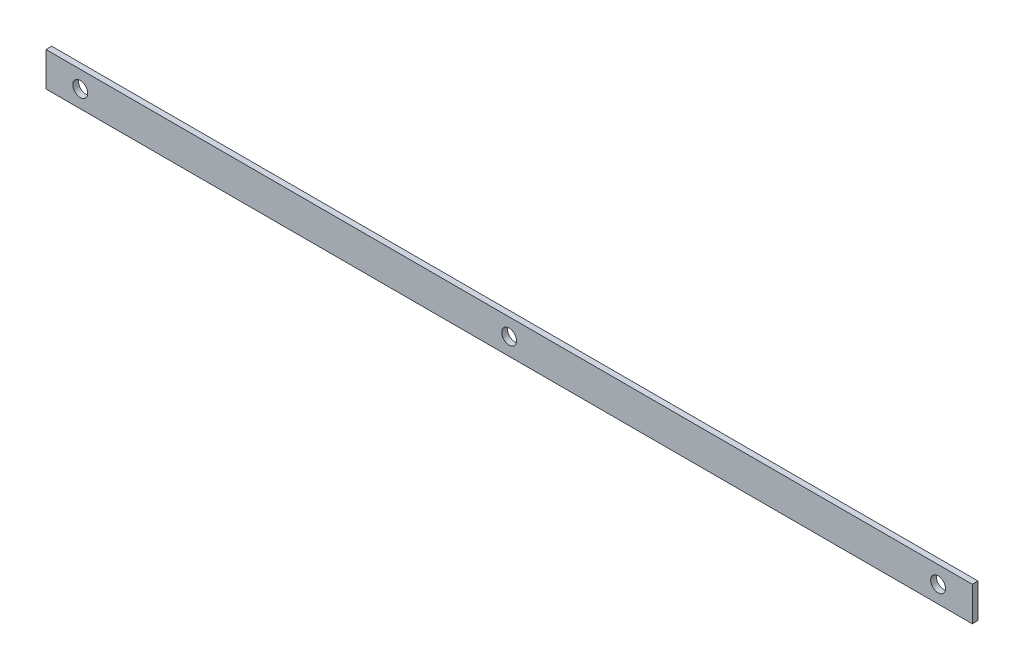
ISO-10303-21;
HEADER;
FILE_DESCRIPTION(('STEP AP214'),'2;1');
FILE_NAME('part.step','',(''),(''),'','','');
FILE_SCHEMA(('AUTOMOTIVE_DESIGN { 1 0 10303 214 1 1 1 1 }'));
ENDSEC;
DATA;
#1=APPLICATION_CONTEXT('core data for automotive mechanical design processes');
#2=APPLICATION_PROTOCOL_DEFINITION('international standard','automotive_design',2000,#1);
#3=PRODUCT_CONTEXT('',#1,'mechanical');
#4=PRODUCT('Part','Part','',(#3));
#5=PRODUCT_RELATED_PRODUCT_CATEGORY('part','',(#4));
#6=PRODUCT_DEFINITION_FORMATION('','',#4);
#7=PRODUCT_DEFINITION_CONTEXT('part definition',#1,'design');
#8=PRODUCT_DEFINITION('design','',#6,#7);
#9=PRODUCT_DEFINITION_SHAPE('','',#8);
#10=(LENGTH_UNIT() NAMED_UNIT(*) SI_UNIT(.MILLI.,.METRE.));
#11=(NAMED_UNIT(*) PLANE_ANGLE_UNIT() SI_UNIT($,.RADIAN.));
#12=(NAMED_UNIT(*) SI_UNIT($,.STERADIAN.) SOLID_ANGLE_UNIT());
#13=UNCERTAINTY_MEASURE_WITH_UNIT(LENGTH_MEASURE(1.E-05),#10,'distance_accuracy_value','');
#14=(GEOMETRIC_REPRESENTATION_CONTEXT(3) GLOBAL_UNCERTAINTY_ASSIGNED_CONTEXT((#13)) GLOBAL_UNIT_ASSIGNED_CONTEXT((#10,
#11,#12)) REPRESENTATION_CONTEXT('',''));
#15=CARTESIAN_POINT('',(0.,0.,0.));
#16=DIRECTION('',(0.,0.,1.));
#17=DIRECTION('',(1.,0.,0.));
#18=AXIS2_PLACEMENT_3D('',#15,#16,#17);
#19=CARTESIAN_POINT('',(376.,0.,-2.5));
#20=DIRECTION('',(0.,0.,-1.));
#21=DIRECTION('',(-1.,0.,0.));
#22=AXIS2_PLACEMENT_3D('',#19,#20,#21);
#23=CYLINDRICAL_SURFACE('',#22,6.50000000000001);
#24=CARTESIAN_POINT('',(376.,0.,2.5));
#25=DIRECTION('',(0.,0.,-1.));
#26=DIRECTION('',(-1.,0.,0.));
#27=AXIS2_PLACEMENT_3D('',#24,#25,#26);
#28=CIRCLE('',#27,6.50000000000001);
#29=CARTESIAN_POINT('',(369.5,0.,2.5));
#30=VERTEX_POINT('',#29);
#31=EDGE_CURVE('E58',#30,#30,#28,.T.);
#32=ORIENTED_EDGE('',*,*,#31,.F.);
#33=EDGE_LOOP('',(#32));
#34=FACE_BOUND('',#33,.T.);
#35=CARTESIAN_POINT('',(376.,0.,-2.5));
#36=DIRECTION('',(0.,0.,-1.));
#37=DIRECTION('',(-1.,0.,0.));
#38=AXIS2_PLACEMENT_3D('',#35,#36,#37);
#39=CIRCLE('',#38,6.50000000000001);
#40=CARTESIAN_POINT('',(369.5,0.,-2.5));
#41=VERTEX_POINT('',#40);
#42=EDGE_CURVE('E12',#41,#41,#39,.T.);
#43=ORIENTED_EDGE('',*,*,#42,.T.);
#44=EDGE_LOOP('',(#43));
#45=FACE_BOUND('',#44,.T.);
#46=ADVANCED_FACE('F50',(#34,#45),#23,.F.);
#47=CARTESIAN_POINT('',(406.,-15.,2.5));
#48=DIRECTION('',(0.,1.,0.));
#49=DIRECTION('',(0.,0.,1.));
#50=AXIS2_PLACEMENT_3D('',#47,#48,#49);
#51=PLANE('',#50);
#52=DIRECTION('',(0.,0.,-1.));
#53=VECTOR('',#52,1.);
#54=CARTESIAN_POINT('',(-406.,-15.,2.5));
#55=LINE('',#54,#53);
#56=CARTESIAN_POINT('',(-406.,-15.,2.5));
#57=VERTEX_POINT('',#56);
#58=CARTESIAN_POINT('',(-406.,-15.,-2.5));
#59=VERTEX_POINT('',#58);
#60=EDGE_CURVE('E118',#57,#59,#55,.T.);
#61=ORIENTED_EDGE('',*,*,#60,.T.);
#62=DIRECTION('',(-1.,0.,0.));
#63=VECTOR('',#62,1.);
#64=CARTESIAN_POINT('',(406.,-15.,-2.5));
#65=LINE('',#64,#63);
#66=CARTESIAN_POINT('',(406.,-15.,-2.5));
#67=VERTEX_POINT('',#66);
#68=EDGE_CURVE('E109',#67,#59,#65,.T.);
#69=ORIENTED_EDGE('',*,*,#68,.F.);
#70=DIRECTION('',(0.,0.,-1.));
#71=VECTOR('',#70,1.);
#72=CARTESIAN_POINT('',(406.,-15.,2.5));
#73=LINE('',#72,#71);
#74=CARTESIAN_POINT('',(406.,-15.,2.5));
#75=VERTEX_POINT('',#74);
#76=EDGE_CURVE('E102',#75,#67,#73,.T.);
#77=ORIENTED_EDGE('',*,*,#76,.F.);
#78=DIRECTION('',(-1.,0.,0.));
#79=VECTOR('',#78,1.);
#80=CARTESIAN_POINT('',(406.,-15.,2.5));
#81=LINE('',#80,#79);
#82=EDGE_CURVE('E114',#75,#57,#81,.T.);
#83=ORIENTED_EDGE('',*,*,#82,.T.);
#84=EDGE_LOOP('',(#61,#69,#77,#83));
#85=FACE_BOUND('',#84,.T.);
#86=ADVANCED_FACE('F134',(#85),#51,.F.);
#87=CARTESIAN_POINT('',(406.,-15.,-2.5));
#88=DIRECTION('',(0.,0.,1.));
#89=DIRECTION('',(1.,0.,0.));
#90=AXIS2_PLACEMENT_3D('',#87,#88,#89);
#91=PLANE('',#90);
#92=CARTESIAN_POINT('',(0.,0.,-2.5));
#93=DIRECTION('',(0.,0.,-1.));
#94=DIRECTION('',(-1.,0.,0.));
#95=AXIS2_PLACEMENT_3D('',#92,#93,#94);
#96=CIRCLE('',#95,6.50000000000001);
#97=CARTESIAN_POINT('',(-6.50000000000001,0.,-2.5));
#98=VERTEX_POINT('',#97);
#99=EDGE_CURVE('E171',#98,#98,#96,.T.);
#100=ORIENTED_EDGE('',*,*,#99,.F.);
#101=EDGE_LOOP('',(#100));
#102=FACE_BOUND('',#101,.T.);
#103=CARTESIAN_POINT('',(-376.,0.,-2.5));
#104=DIRECTION('',(0.,0.,-1.));
#105=DIRECTION('',(-1.,0.,0.));
#106=AXIS2_PLACEMENT_3D('',#103,#104,#105);
#107=CIRCLE('',#106,6.50000000000001);
#108=CARTESIAN_POINT('',(-382.5,0.,-2.5));
#109=VERTEX_POINT('',#108);
#110=EDGE_CURVE('E172',#109,#109,#107,.T.);
#111=ORIENTED_EDGE('',*,*,#110,.F.);
#112=EDGE_LOOP('',(#111));
#113=FACE_BOUND('',#112,.T.);
#114=DIRECTION('',(0.,1.,0.));
#115=VECTOR('',#114,1.);
#116=CARTESIAN_POINT('',(-406.,-15.,-2.5));
#117=LINE('',#116,#115);
#118=CARTESIAN_POINT('',(-406.,15.,-2.5));
#119=VERTEX_POINT('',#118);
#120=EDGE_CURVE('E108',#59,#119,#117,.T.);
#121=ORIENTED_EDGE('',*,*,#120,.T.);
#122=DIRECTION('',(-1.,0.,0.));
#123=VECTOR('',#122,1.);
#124=CARTESIAN_POINT('',(406.,15.,-2.5));
#125=LINE('',#124,#123);
#126=CARTESIAN_POINT('',(406.,15.,-2.5));
#127=VERTEX_POINT('',#126);
#128=EDGE_CURVE('E105',#127,#119,#125,.T.);
#129=ORIENTED_EDGE('',*,*,#128,.F.);
#130=DIRECTION('',(0.,1.,0.));
#131=VECTOR('',#130,1.);
#132=CARTESIAN_POINT('',(406.,-15.,-2.5));
#133=LINE('',#132,#131);
#134=EDGE_CURVE('E97',#67,#127,#133,.T.);
#135=ORIENTED_EDGE('',*,*,#134,.F.);
#136=ORIENTED_EDGE('',*,*,#68,.T.);
#137=EDGE_LOOP('',(#121,#129,#135,#136));
#138=FACE_BOUND('',#137,.T.);
#139=ORIENTED_EDGE('',*,*,#42,.F.);
#140=EDGE_LOOP('',(#139));
#141=FACE_BOUND('',#140,.T.);
#142=ADVANCED_FACE('F106',(#102,#113,#138,#141),#91,.F.);
#143=CARTESIAN_POINT('',(406.,15.,2.5));
#144=DIRECTION('',(0.,-1.,0.));
#145=DIRECTION('',(0.,0.,-1.));
#146=AXIS2_PLACEMENT_3D('',#143,#144,#145);
#147=PLANE('',#146);
#148=DIRECTION('',(0.,0.,1.));
#149=VECTOR('',#148,1.);
#150=CARTESIAN_POINT('',(-406.,15.,2.5));
#151=LINE('',#150,#149);
#152=CARTESIAN_POINT('',(-406.,15.,2.5));
#153=VERTEX_POINT('',#152);
#154=EDGE_CURVE('E83',#119,#153,#151,.T.);
#155=ORIENTED_EDGE('',*,*,#154,.T.);
#156=DIRECTION('',(-1.,0.,0.));
#157=VECTOR('',#156,1.);
#158=CARTESIAN_POINT('',(406.,15.,2.5));
#159=LINE('',#158,#157);
#160=CARTESIAN_POINT('',(406.,15.,2.5));
#161=VERTEX_POINT('',#160);
#162=EDGE_CURVE('E110',#161,#153,#159,.T.);
#163=ORIENTED_EDGE('',*,*,#162,.F.);
#164=DIRECTION('',(0.,0.,1.));
#165=VECTOR('',#164,1.);
#166=CARTESIAN_POINT('',(406.,15.,2.5));
#167=LINE('',#166,#165);
#168=EDGE_CURVE('E100',#127,#161,#167,.T.);
#169=ORIENTED_EDGE('',*,*,#168,.F.);
#170=ORIENTED_EDGE('',*,*,#128,.T.);
#171=EDGE_LOOP('',(#155,#163,#169,#170));
#172=FACE_BOUND('',#171,.T.);
#173=ADVANCED_FACE('F112',(#172),#147,.F.);
#174=CARTESIAN_POINT('',(406.,-15.,2.5));
#175=DIRECTION('',(0.,0.,-1.));
#176=DIRECTION('',(-1.,0.,0.));
#177=AXIS2_PLACEMENT_3D('',#174,#175,#176);
#178=PLANE('',#177);
#179=CARTESIAN_POINT('',(0.,0.,2.5));
#180=DIRECTION('',(0.,0.,-1.));
#181=DIRECTION('',(-1.,0.,0.));
#182=AXIS2_PLACEMENT_3D('',#179,#180,#181);
#183=CIRCLE('',#182,6.50000000000001);
#184=CARTESIAN_POINT('',(-6.50000000000001,0.,2.5));
#185=VERTEX_POINT('',#184);
#186=EDGE_CURVE('E169',#185,#185,#183,.T.);
#187=ORIENTED_EDGE('',*,*,#186,.T.);
#188=EDGE_LOOP('',(#187));
#189=FACE_BOUND('',#188,.T.);
#190=CARTESIAN_POINT('',(-376.,0.,2.5));
#191=DIRECTION('',(0.,0.,-1.));
#192=DIRECTION('',(-1.,0.,0.));
#193=AXIS2_PLACEMENT_3D('',#190,#191,#192);
#194=CIRCLE('',#193,6.50000000000001);
#195=CARTESIAN_POINT('',(-382.5,0.,2.5));
#196=VERTEX_POINT('',#195);
#197=EDGE_CURVE('E121',#196,#196,#194,.T.);
#198=ORIENTED_EDGE('',*,*,#197,.T.);
#199=EDGE_LOOP('',(#198));
#200=FACE_BOUND('',#199,.T.);
#201=DIRECTION('',(0.,-1.,0.));
#202=VECTOR('',#201,1.);
#203=CARTESIAN_POINT('',(-406.,-15.,2.5));
#204=LINE('',#203,#202);
#205=EDGE_CURVE('E89',#153,#57,#204,.T.);
#206=ORIENTED_EDGE('',*,*,#205,.T.);
#207=ORIENTED_EDGE('',*,*,#82,.F.);
#208=DIRECTION('',(0.,-1.,0.));
#209=VECTOR('',#208,1.);
#210=CARTESIAN_POINT('',(406.,-15.,2.5));
#211=LINE('',#210,#209);
#212=EDGE_CURVE('E66',#161,#75,#211,.T.);
#213=ORIENTED_EDGE('',*,*,#212,.F.);
#214=ORIENTED_EDGE('',*,*,#162,.T.);
#215=EDGE_LOOP('',(#206,#207,#213,#214));
#216=FACE_BOUND('',#215,.T.);
#217=ORIENTED_EDGE('',*,*,#31,.T.);
#218=EDGE_LOOP('',(#217));
#219=FACE_BOUND('',#218,.T.);
#220=ADVANCED_FACE('F130',(#189,#200,#216,#219),#178,.F.);
#221=CARTESIAN_POINT('',(406.,-15.,-2.5));
#222=DIRECTION('',(1.,0.,0.));
#223=DIRECTION('',(0.,0.,-1.));
#224=AXIS2_PLACEMENT_3D('',#221,#222,#223);
#225=PLANE('',#224);
#226=ORIENTED_EDGE('',*,*,#76,.T.);
#227=ORIENTED_EDGE('',*,*,#134,.T.);
#228=ORIENTED_EDGE('',*,*,#168,.T.);
#229=ORIENTED_EDGE('',*,*,#212,.T.);
#230=EDGE_LOOP('',(#226,#227,#228,#229));
#231=FACE_BOUND('',#230,.T.);
#232=ADVANCED_FACE('F98',(#231),#225,.T.);
#233=CARTESIAN_POINT('',(-406.,-15.,-2.5));
#234=DIRECTION('',(1.,0.,0.));
#235=DIRECTION('',(0.,0.,-1.));
#236=AXIS2_PLACEMENT_3D('',#233,#234,#235);
#237=PLANE('',#236);
#238=ORIENTED_EDGE('',*,*,#60,.F.);
#239=ORIENTED_EDGE('',*,*,#205,.F.);
#240=ORIENTED_EDGE('',*,*,#154,.F.);
#241=ORIENTED_EDGE('',*,*,#120,.F.);
#242=EDGE_LOOP('',(#238,#239,#240,#241));
#243=FACE_BOUND('',#242,.T.);
#244=ADVANCED_FACE('F151',(#243),#237,.F.);
#245=CARTESIAN_POINT('',(-376.,0.,-2.5));
#246=DIRECTION('',(0.,0.,-1.));
#247=DIRECTION('',(-1.,0.,0.));
#248=AXIS2_PLACEMENT_3D('',#245,#246,#247);
#249=CYLINDRICAL_SURFACE('',#248,6.50000000000001);
#250=ORIENTED_EDGE('',*,*,#197,.F.);
#251=EDGE_LOOP('',(#250));
#252=FACE_BOUND('',#251,.T.);
#253=ORIENTED_EDGE('',*,*,#110,.T.);
#254=EDGE_LOOP('',(#253));
#255=FACE_BOUND('',#254,.T.);
#256=ADVANCED_FACE('F154',(#252,#255),#249,.F.);
#257=CARTESIAN_POINT('',(0.,0.,-2.5));
#258=DIRECTION('',(0.,0.,-1.));
#259=DIRECTION('',(-1.,0.,0.));
#260=AXIS2_PLACEMENT_3D('',#257,#258,#259);
#261=CYLINDRICAL_SURFACE('',#260,6.50000000000001);
#262=ORIENTED_EDGE('',*,*,#186,.F.);
#263=EDGE_LOOP('',(#262));
#264=FACE_BOUND('',#263,.T.);
#265=ORIENTED_EDGE('',*,*,#99,.T.);
#266=EDGE_LOOP('',(#265));
#267=FACE_BOUND('',#266,.T.);
#268=ADVANCED_FACE('F160',(#264,#267),#261,.F.);
#269=CLOSED_SHELL('',(#46,#86,#142,#173,#220,#232,#244,#256,#268));
#270=MANIFOLD_SOLID_BREP('B2',#269);
#271=ADVANCED_BREP_SHAPE_REPRESENTATION('',(#18,#270),#14);
#272=SHAPE_DEFINITION_REPRESENTATION(#9,#271);
ENDSEC;
END-ISO-10303-21;
